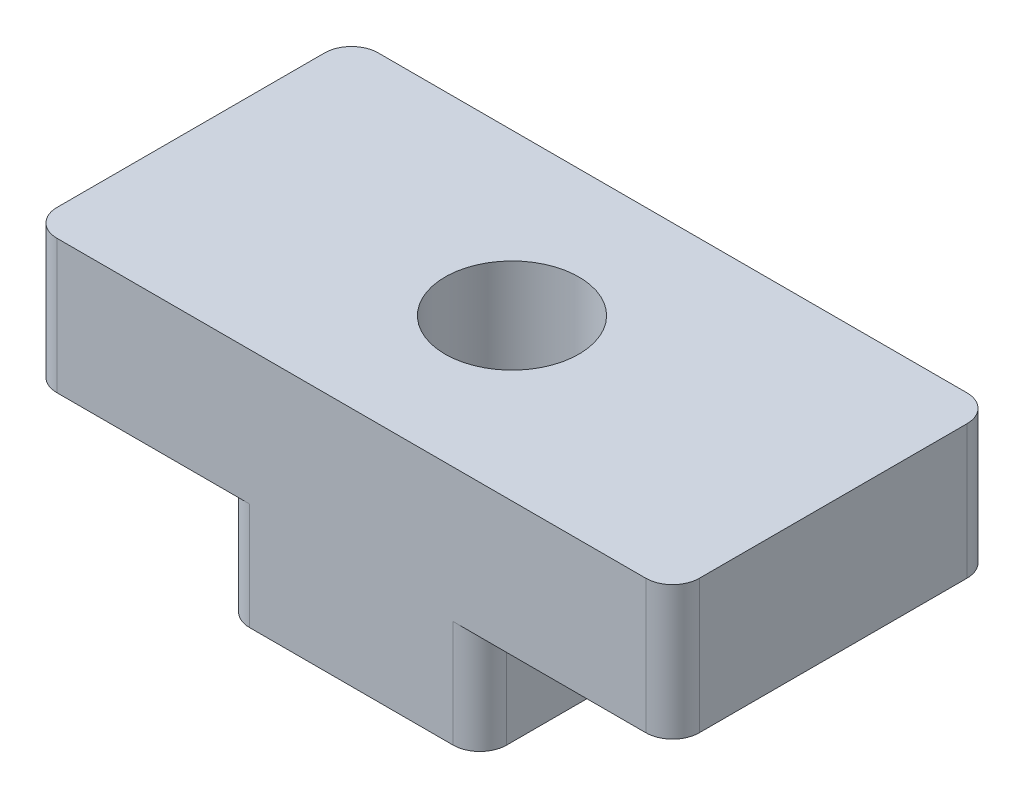
ISO-10303-21;
HEADER;
FILE_DESCRIPTION(('STEP AP214'),'2;1');
FILE_NAME('part.step','',(''),(''),'','','');
FILE_SCHEMA(('AUTOMOTIVE_DESIGN { 1 0 10303 214 1 1 1 1 }'));
ENDSEC;
DATA;
#1=APPLICATION_CONTEXT('core data for automotive mechanical design processes');
#2=APPLICATION_PROTOCOL_DEFINITION('international standard','automotive_design',2000,#1);
#3=PRODUCT_CONTEXT('',#1,'mechanical');
#4=PRODUCT('Part','Part','',(#3));
#5=PRODUCT_RELATED_PRODUCT_CATEGORY('part','',(#4));
#6=PRODUCT_DEFINITION_FORMATION('','',#4);
#7=PRODUCT_DEFINITION_CONTEXT('part definition',#1,'design');
#8=PRODUCT_DEFINITION('design','',#6,#7);
#9=PRODUCT_DEFINITION_SHAPE('','',#8);
#10=(LENGTH_UNIT() NAMED_UNIT(*) SI_UNIT(.MILLI.,.METRE.));
#11=(NAMED_UNIT(*) PLANE_ANGLE_UNIT() SI_UNIT($,.RADIAN.));
#12=(NAMED_UNIT(*) SI_UNIT($,.STERADIAN.) SOLID_ANGLE_UNIT());
#13=UNCERTAINTY_MEASURE_WITH_UNIT(LENGTH_MEASURE(1.E-05),#10,'distance_accuracy_value','');
#14=(GEOMETRIC_REPRESENTATION_CONTEXT(3) GLOBAL_UNCERTAINTY_ASSIGNED_CONTEXT((#13)) GLOBAL_UNIT_ASSIGNED_CONTEXT((#10,
#11,#12)) REPRESENTATION_CONTEXT('',''));
#15=CARTESIAN_POINT('',(0.,0.,0.));
#16=DIRECTION('',(0.,0.,1.));
#17=DIRECTION('',(1.,0.,0.));
#18=AXIS2_PLACEMENT_3D('',#15,#16,#17);
#19=CARTESIAN_POINT('',(6.,0.,3.));
#20=DIRECTION('',(-1.,0.,0.));
#21=DIRECTION('',(0.,0.,1.));
#22=AXIS2_PLACEMENT_3D('',#19,#20,#21);
#23=PLANE('',#22);
#24=DIRECTION('',(0.,0.,-1.));
#25=VECTOR('',#24,1.);
#26=CARTESIAN_POINT('',(6.,2.5,3.));
#27=LINE('',#26,#25);
#28=CARTESIAN_POINT('',(6.,2.5,2.5));
#29=VERTEX_POINT('',#28);
#30=CARTESIAN_POINT('',(6.,2.5,-2.5));
#31=VERTEX_POINT('',#30);
#32=EDGE_CURVE('E192',#29,#31,#27,.T.);
#33=ORIENTED_EDGE('',*,*,#32,.F.);
#34=DIRECTION('',(0.,1.,0.));
#35=VECTOR('',#34,1.);
#36=CARTESIAN_POINT('',(6.,0.,2.5));
#37=LINE('',#36,#35);
#38=CARTESIAN_POINT('',(6.,0.,2.5));
#39=VERTEX_POINT('',#38);
#40=EDGE_CURVE('E266',#29,#39,#37,.F.);
#41=ORIENTED_EDGE('',*,*,#40,.T.);
#42=DIRECTION('',(0.,0.,-1.));
#43=VECTOR('',#42,1.);
#44=CARTESIAN_POINT('',(6.,0.,3.));
#45=LINE('',#44,#43);
#46=CARTESIAN_POINT('',(6.,0.,-2.5));
#47=VERTEX_POINT('',#46);
#48=EDGE_CURVE('E186',#39,#47,#45,.T.);
#49=ORIENTED_EDGE('',*,*,#48,.T.);
#50=DIRECTION('',(0.,1.,0.));
#51=VECTOR('',#50,1.);
#52=CARTESIAN_POINT('',(6.,2.5,-2.5));
#53=LINE('',#52,#51);
#54=EDGE_CURVE('E262',#47,#31,#53,.T.);
#55=ORIENTED_EDGE('',*,*,#54,.T.);
#56=EDGE_LOOP('',(#33,#41,#49,#55));
#57=FACE_BOUND('',#56,.T.);
#58=ADVANCED_FACE('F47',(#57),#23,.F.);
#59=CARTESIAN_POINT('',(-6.,2.5,3.));
#60=DIRECTION('',(0.,-1.,0.));
#61=DIRECTION('',(0.,0.,-1.));
#62=AXIS2_PLACEMENT_3D('',#59,#60,#61);
#63=PLANE('',#62);
#64=CARTESIAN_POINT('',(0.,2.5,0.));
#65=DIRECTION('',(0.,1.,0.));
#66=DIRECTION('',(0.,0.,1.));
#67=AXIS2_PLACEMENT_3D('',#64,#65,#66);
#68=CIRCLE('',#67,1.25);
#69=CARTESIAN_POINT('',(0.,2.5,1.25));
#70=VERTEX_POINT('',#69);
#71=EDGE_CURVE('E360',#70,#70,#68,.T.);
#72=ORIENTED_EDGE('',*,*,#71,.F.);
#73=EDGE_LOOP('',(#72));
#74=FACE_BOUND('',#73,.T.);
#75=DIRECTION('',(-1.,0.,0.));
#76=VECTOR('',#75,1.);
#77=CARTESIAN_POINT('',(-6.,2.5,3.));
#78=LINE('',#77,#76);
#79=CARTESIAN_POINT('',(5.5,2.5,3.));
#80=VERTEX_POINT('',#79);
#81=CARTESIAN_POINT('',(-5.5,2.5,3.));
#82=VERTEX_POINT('',#81);
#83=EDGE_CURVE('E327',#80,#82,#78,.T.);
#84=ORIENTED_EDGE('',*,*,#83,.F.);
#85=CARTESIAN_POINT('',(5.5,2.5,2.5));
#86=DIRECTION('',(0.,-1.,0.));
#87=DIRECTION('',(0.,0.,-1.));
#88=AXIS2_PLACEMENT_3D('',#85,#86,#87);
#89=CIRCLE('',#88,0.5);
#90=EDGE_CURVE('E259',#80,#29,#89,.F.);
#91=ORIENTED_EDGE('',*,*,#90,.T.);
#92=ORIENTED_EDGE('',*,*,#32,.T.);
#93=CARTESIAN_POINT('',(5.5,2.5,-2.5));
#94=DIRECTION('',(0.,-1.,0.));
#95=DIRECTION('',(0.,0.,-1.));
#96=AXIS2_PLACEMENT_3D('',#93,#94,#95);
#97=CIRCLE('',#96,0.5);
#98=CARTESIAN_POINT('',(5.5,2.5,-3.));
#99=VERTEX_POINT('',#98);
#100=EDGE_CURVE('E253',#31,#99,#97,.F.);
#101=ORIENTED_EDGE('',*,*,#100,.T.);
#102=DIRECTION('',(-1.,0.,0.));
#103=VECTOR('',#102,1.);
#104=CARTESIAN_POINT('',(-6.,2.5,-3.));
#105=LINE('',#104,#103);
#106=CARTESIAN_POINT('',(-5.5,2.5,-3.));
#107=VERTEX_POINT('',#106);
#108=EDGE_CURVE('E330',#99,#107,#105,.T.);
#109=ORIENTED_EDGE('',*,*,#108,.T.);
#110=CARTESIAN_POINT('',(-5.5,2.5,-2.5));
#111=DIRECTION('',(0.,-1.,0.));
#112=DIRECTION('',(0.,0.,-1.));
#113=AXIS2_PLACEMENT_3D('',#110,#111,#112);
#114=CIRCLE('',#113,0.5);
#115=CARTESIAN_POINT('',(-6.,2.5,-2.5));
#116=VERTEX_POINT('',#115);
#117=EDGE_CURVE('E250',#107,#116,#114,.F.);
#118=ORIENTED_EDGE('',*,*,#117,.T.);
#119=DIRECTION('',(0.,0.,-1.));
#120=VECTOR('',#119,1.);
#121=CARTESIAN_POINT('',(-6.,2.5,3.));
#122=LINE('',#121,#120);
#123=CARTESIAN_POINT('',(-6.,2.5,2.5));
#124=VERTEX_POINT('',#123);
#125=EDGE_CURVE('E202',#124,#116,#122,.T.);
#126=ORIENTED_EDGE('',*,*,#125,.F.);
#127=CARTESIAN_POINT('',(-5.5,2.5,2.5));
#128=DIRECTION('',(0.,-1.,0.));
#129=DIRECTION('',(0.,0.,-1.));
#130=AXIS2_PLACEMENT_3D('',#127,#128,#129);
#131=CIRCLE('',#130,0.5);
#132=EDGE_CURVE('E256',#124,#82,#131,.F.);
#133=ORIENTED_EDGE('',*,*,#132,.T.);
#134=EDGE_LOOP('',(#84,#91,#92,#101,#109,#118,#126,#133));
#135=FACE_BOUND('',#134,.T.);
#136=ADVANCED_FACE('F352',(#74,#135),#63,.F.);
#137=CARTESIAN_POINT('',(-6.,0.,3.));
#138=DIRECTION('',(1.,0.,0.));
#139=DIRECTION('',(0.,0.,-1.));
#140=AXIS2_PLACEMENT_3D('',#137,#138,#139);
#141=PLANE('',#140);
#142=DIRECTION('',(0.,0.,-1.));
#143=VECTOR('',#142,1.);
#144=CARTESIAN_POINT('',(-6.,0.,3.));
#145=LINE('',#144,#143);
#146=CARTESIAN_POINT('',(-6.,0.,2.5));
#147=VERTEX_POINT('',#146);
#148=CARTESIAN_POINT('',(-6.,0.,-2.5));
#149=VERTEX_POINT('',#148);
#150=EDGE_CURVE('E307',#147,#149,#145,.T.);
#151=ORIENTED_EDGE('',*,*,#150,.F.);
#152=DIRECTION('',(0.,-1.,0.));
#153=VECTOR('',#152,1.);
#154=CARTESIAN_POINT('',(-6.,0.,2.5));
#155=LINE('',#154,#153);
#156=EDGE_CURVE('E282',#147,#124,#155,.F.);
#157=ORIENTED_EDGE('',*,*,#156,.T.);
#158=ORIENTED_EDGE('',*,*,#125,.T.);
#159=DIRECTION('',(0.,-1.,0.));
#160=VECTOR('',#159,1.);
#161=CARTESIAN_POINT('',(-6.,0.,-2.5));
#162=LINE('',#161,#160);
#163=EDGE_CURVE('E279',#116,#149,#162,.T.);
#164=ORIENTED_EDGE('',*,*,#163,.T.);
#165=EDGE_LOOP('',(#151,#157,#158,#164));
#166=FACE_BOUND('',#165,.T.);
#167=ADVANCED_FACE('F345',(#166),#141,.F.);
#168=CARTESIAN_POINT('',(-6.,0.,3.));
#169=DIRECTION('',(0.,1.,0.));
#170=DIRECTION('',(-1.,0.,0.));
#171=AXIS2_PLACEMENT_3D('',#168,#169,#170);
#172=PLANE('',#171);
#173=DIRECTION('',(1.,0.,0.));
#174=VECTOR('',#173,1.);
#175=CARTESIAN_POINT('',(-6.,0.,3.));
#176=LINE('',#175,#174);
#177=CARTESIAN_POINT('',(-5.5,0.,3.));
#178=VERTEX_POINT('',#177);
#179=CARTESIAN_POINT('',(-1.9,0.,3.));
#180=VERTEX_POINT('',#179);
#181=EDGE_CURVE('E369',#178,#180,#176,.T.);
#182=ORIENTED_EDGE('',*,*,#181,.F.);
#183=CARTESIAN_POINT('',(-5.5,0.,2.5));
#184=DIRECTION('',(0.,1.,0.));
#185=DIRECTION('',(-1.,0.,0.));
#186=AXIS2_PLACEMENT_3D('',#183,#184,#185);
#187=CIRCLE('',#186,0.5);
#188=EDGE_CURVE('E71',#178,#147,#187,.F.);
#189=ORIENTED_EDGE('',*,*,#188,.T.);
#190=ORIENTED_EDGE('',*,*,#150,.T.);
#191=CARTESIAN_POINT('',(-5.5,0.,-2.5));
#192=DIRECTION('',(0.,1.,0.));
#193=DIRECTION('',(-1.,0.,0.));
#194=AXIS2_PLACEMENT_3D('',#191,#192,#193);
#195=CIRCLE('',#194,0.5);
#196=CARTESIAN_POINT('',(-5.5,0.,-3.));
#197=VERTEX_POINT('',#196);
#198=EDGE_CURVE('E63',#149,#197,#195,.F.);
#199=ORIENTED_EDGE('',*,*,#198,.T.);
#200=DIRECTION('',(1.,0.,0.));
#201=VECTOR('',#200,1.);
#202=CARTESIAN_POINT('',(-6.,0.,-3.));
#203=LINE('',#202,#201);
#204=CARTESIAN_POINT('',(-1.9,0.,-3.));
#205=VERTEX_POINT('',#204);
#206=EDGE_CURVE('E297',#197,#205,#203,.T.);
#207=ORIENTED_EDGE('',*,*,#206,.T.);
#208=CARTESIAN_POINT('',(-1.9,0.,-2.5));
#209=DIRECTION('',(0.,1.,0.));
#210=DIRECTION('',(-1.,0.,0.));
#211=AXIS2_PLACEMENT_3D('',#208,#209,#210);
#212=CIRCLE('',#211,0.5);
#213=CARTESIAN_POINT('',(-2.4,0.,-2.5));
#214=VERTEX_POINT('',#213);
#215=EDGE_CURVE('E175',#205,#214,#212,.T.);
#216=ORIENTED_EDGE('',*,*,#215,.T.);
#217=DIRECTION('',(0.,0.,-1.));
#218=VECTOR('',#217,1.);
#219=CARTESIAN_POINT('',(-2.4,0.,3.));
#220=LINE('',#219,#218);
#221=CARTESIAN_POINT('',(-2.4,0.,2.5));
#222=VERTEX_POINT('',#221);
#223=EDGE_CURVE('E294',#222,#214,#220,.T.);
#224=ORIENTED_EDGE('',*,*,#223,.F.);
#225=CARTESIAN_POINT('',(-1.9,0.,2.5));
#226=DIRECTION('',(0.,1.,0.));
#227=DIRECTION('',(-1.,0.,0.));
#228=AXIS2_PLACEMENT_3D('',#225,#226,#227);
#229=CIRCLE('',#228,0.5);
#230=EDGE_CURVE('E11',#222,#180,#229,.T.);
#231=ORIENTED_EDGE('',*,*,#230,.T.);
#232=EDGE_LOOP('',(#182,#189,#190,#199,#207,#216,#224,#231));
#233=FACE_BOUND('',#232,.T.);
#234=ADVANCED_FACE('F293',(#233),#172,.F.);
#235=CARTESIAN_POINT('',(-2.4,0.,3.));
#236=DIRECTION('',(1.,0.,0.));
#237=DIRECTION('',(0.,1.,0.));
#238=AXIS2_PLACEMENT_3D('',#235,#236,#237);
#239=PLANE('',#238);
#240=ORIENTED_EDGE('',*,*,#223,.T.);
#241=DIRECTION('',(0.,-1.,0.));
#242=VECTOR('',#241,1.);
#243=CARTESIAN_POINT('',(-2.4,-2.,-2.5));
#244=LINE('',#243,#242);
#245=CARTESIAN_POINT('',(-2.4,-2.,-2.5));
#246=VERTEX_POINT('',#245);
#247=EDGE_CURVE('E231',#214,#246,#244,.T.);
#248=ORIENTED_EDGE('',*,*,#247,.T.);
#249=DIRECTION('',(0.,0.,-1.));
#250=VECTOR('',#249,1.);
#251=CARTESIAN_POINT('',(-2.4,-2.,3.));
#252=LINE('',#251,#250);
#253=CARTESIAN_POINT('',(-2.4,-2.,2.5));
#254=VERTEX_POINT('',#253);
#255=EDGE_CURVE('E308',#254,#246,#252,.T.);
#256=ORIENTED_EDGE('',*,*,#255,.F.);
#257=DIRECTION('',(0.,-1.,0.));
#258=VECTOR('',#257,1.);
#259=CARTESIAN_POINT('',(-2.4,0.,2.5));
#260=LINE('',#259,#258);
#261=EDGE_CURVE('E228',#254,#222,#260,.F.);
#262=ORIENTED_EDGE('',*,*,#261,.T.);
#263=EDGE_LOOP('',(#240,#248,#256,#262));
#264=FACE_BOUND('',#263,.T.);
#265=ADVANCED_FACE('F302',(#264),#239,.F.);
#266=CARTESIAN_POINT('',(-2.4,-2.,3.));
#267=DIRECTION('',(0.,1.,0.));
#268=DIRECTION('',(-1.,0.,0.));
#269=AXIS2_PLACEMENT_3D('',#266,#267,#268);
#270=PLANE('',#269);
#271=CARTESIAN_POINT('',(0.,-2.,0.));
#272=DIRECTION('',(0.,1.,0.));
#273=DIRECTION('',(0.,0.,1.));
#274=AXIS2_PLACEMENT_3D('',#271,#272,#273);
#275=CIRCLE('',#274,1.25);
#276=CARTESIAN_POINT('',(0.,-2.,1.25));
#277=VERTEX_POINT('',#276);
#278=EDGE_CURVE('E356',#277,#277,#275,.T.);
#279=ORIENTED_EDGE('',*,*,#278,.T.);
#280=EDGE_LOOP('',(#279));
#281=FACE_BOUND('',#280,.T.);
#282=DIRECTION('',(1.,0.,0.));
#283=VECTOR('',#282,1.);
#284=CARTESIAN_POINT('',(-2.4,-2.,-3.));
#285=LINE('',#284,#283);
#286=CARTESIAN_POINT('',(-1.9,-2.,-3.));
#287=VERTEX_POINT('',#286);
#288=CARTESIAN_POINT('',(1.9,-2.,-3.));
#289=VERTEX_POINT('',#288);
#290=EDGE_CURVE('E315',#287,#289,#285,.T.);
#291=ORIENTED_EDGE('',*,*,#290,.T.);
#292=CARTESIAN_POINT('',(1.9,-2.,-2.5));
#293=DIRECTION('',(0.,1.,0.));
#294=DIRECTION('',(-1.,0.,0.));
#295=AXIS2_PLACEMENT_3D('',#292,#293,#294);
#296=CIRCLE('',#295,0.5);
#297=CARTESIAN_POINT('',(2.4,-2.,-2.5));
#298=VERTEX_POINT('',#297);
#299=EDGE_CURVE('E225',#289,#298,#296,.F.);
#300=ORIENTED_EDGE('',*,*,#299,.T.);
#301=DIRECTION('',(0.,0.,-1.));
#302=VECTOR('',#301,1.);
#303=CARTESIAN_POINT('',(2.4,-2.,3.));
#304=LINE('',#303,#302);
#305=CARTESIAN_POINT('',(2.4,-2.,2.5));
#306=VERTEX_POINT('',#305);
#307=EDGE_CURVE('E185',#306,#298,#304,.T.);
#308=ORIENTED_EDGE('',*,*,#307,.F.);
#309=CARTESIAN_POINT('',(1.9,-2.,2.5));
#310=DIRECTION('',(0.,1.,0.));
#311=DIRECTION('',(-1.,0.,0.));
#312=AXIS2_PLACEMENT_3D('',#309,#310,#311);
#313=CIRCLE('',#312,0.5);
#314=CARTESIAN_POINT('',(1.9,-2.,3.));
#315=VERTEX_POINT('',#314);
#316=EDGE_CURVE('E190',#306,#315,#313,.F.);
#317=ORIENTED_EDGE('',*,*,#316,.T.);
#318=DIRECTION('',(1.,0.,0.));
#319=VECTOR('',#318,1.);
#320=CARTESIAN_POINT('',(-2.4,-2.,3.));
#321=LINE('',#320,#319);
#322=CARTESIAN_POINT('',(-1.9,-2.,3.));
#323=VERTEX_POINT('',#322);
#324=EDGE_CURVE('E365',#323,#315,#321,.T.);
#325=ORIENTED_EDGE('',*,*,#324,.F.);
#326=CARTESIAN_POINT('',(-1.9,-2.,2.5));
#327=DIRECTION('',(0.,1.,0.));
#328=DIRECTION('',(-1.,0.,0.));
#329=AXIS2_PLACEMENT_3D('',#326,#327,#328);
#330=CIRCLE('',#329,0.5);
#331=EDGE_CURVE('E218',#323,#254,#330,.F.);
#332=ORIENTED_EDGE('',*,*,#331,.T.);
#333=ORIENTED_EDGE('',*,*,#255,.T.);
#334=CARTESIAN_POINT('',(-1.9,-2.,-2.5));
#335=DIRECTION('',(0.,1.,0.));
#336=DIRECTION('',(-1.,0.,0.));
#337=AXIS2_PLACEMENT_3D('',#334,#335,#336);
#338=CIRCLE('',#337,0.5);
#339=EDGE_CURVE('E222',#246,#287,#338,.F.);
#340=ORIENTED_EDGE('',*,*,#339,.T.);
#341=EDGE_LOOP('',(#291,#300,#308,#317,#325,#332,#333,#340));
#342=FACE_BOUND('',#341,.T.);
#343=ADVANCED_FACE('F314',(#281,#342),#270,.F.);
#344=CARTESIAN_POINT('',(2.4,0.,3.));
#345=DIRECTION('',(-1.,0.,0.));
#346=DIRECTION('',(0.,-1.,0.));
#347=AXIS2_PLACEMENT_3D('',#344,#345,#346);
#348=PLANE('',#347);
#349=ORIENTED_EDGE('',*,*,#307,.T.);
#350=DIRECTION('',(0.,1.,0.));
#351=VECTOR('',#350,1.);
#352=CARTESIAN_POINT('',(2.4,0.,-2.5));
#353=LINE('',#352,#351);
#354=CARTESIAN_POINT('',(2.4,0.,-2.5));
#355=VERTEX_POINT('',#354);
#356=EDGE_CURVE('E183',#298,#355,#353,.T.);
#357=ORIENTED_EDGE('',*,*,#356,.T.);
#358=DIRECTION('',(0.,0.,-1.));
#359=VECTOR('',#358,1.);
#360=CARTESIAN_POINT('',(2.4,0.,3.));
#361=LINE('',#360,#359);
#362=CARTESIAN_POINT('',(2.4,0.,2.5));
#363=VERTEX_POINT('',#362);
#364=EDGE_CURVE('E167',#363,#355,#361,.T.);
#365=ORIENTED_EDGE('',*,*,#364,.F.);
#366=DIRECTION('',(0.,1.,0.));
#367=VECTOR('',#366,1.);
#368=CARTESIAN_POINT('',(2.4,0.,2.5));
#369=LINE('',#368,#367);
#370=EDGE_CURVE('E180',#363,#306,#369,.F.);
#371=ORIENTED_EDGE('',*,*,#370,.T.);
#372=EDGE_LOOP('',(#349,#357,#365,#371));
#373=FACE_BOUND('',#372,.T.);
#374=ADVANCED_FACE('F179',(#373),#348,.F.);
#375=CARTESIAN_POINT('',(6.,0.,3.));
#376=DIRECTION('',(0.,1.,0.));
#377=DIRECTION('',(-1.,0.,0.));
#378=AXIS2_PLACEMENT_3D('',#375,#376,#377);
#379=PLANE('',#378);
#380=ORIENTED_EDGE('',*,*,#48,.F.);
#381=CARTESIAN_POINT('',(5.5,0.,2.5));
#382=DIRECTION('',(0.,1.,0.));
#383=DIRECTION('',(-1.,0.,0.));
#384=AXIS2_PLACEMENT_3D('',#381,#382,#383);
#385=CIRCLE('',#384,0.5);
#386=CARTESIAN_POINT('',(5.5,0.,3.));
#387=VERTEX_POINT('',#386);
#388=EDGE_CURVE('E272',#39,#387,#385,.F.);
#389=ORIENTED_EDGE('',*,*,#388,.T.);
#390=DIRECTION('',(1.,0.,0.));
#391=VECTOR('',#390,1.);
#392=CARTESIAN_POINT('',(6.,0.,3.));
#393=LINE('',#392,#391);
#394=CARTESIAN_POINT('',(1.9,0.,3.));
#395=VERTEX_POINT('',#394);
#396=EDGE_CURVE('E169',#395,#387,#393,.T.);
#397=ORIENTED_EDGE('',*,*,#396,.F.);
#398=CARTESIAN_POINT('',(1.9,0.,2.5));
#399=DIRECTION('',(0.,1.,0.));
#400=DIRECTION('',(-1.,0.,0.));
#401=AXIS2_PLACEMENT_3D('',#398,#399,#400);
#402=CIRCLE('',#401,0.5);
#403=EDGE_CURVE('E56',#395,#363,#402,.T.);
#404=ORIENTED_EDGE('',*,*,#403,.T.);
#405=ORIENTED_EDGE('',*,*,#364,.T.);
#406=CARTESIAN_POINT('',(1.9,0.,-2.5));
#407=DIRECTION('',(0.,1.,0.));
#408=DIRECTION('',(-1.,0.,0.));
#409=AXIS2_PLACEMENT_3D('',#406,#407,#408);
#410=CIRCLE('',#409,0.5);
#411=CARTESIAN_POINT('',(1.9,0.,-3.));
#412=VERTEX_POINT('',#411);
#413=EDGE_CURVE('E285',#355,#412,#410,.T.);
#414=ORIENTED_EDGE('',*,*,#413,.T.);
#415=DIRECTION('',(1.,0.,0.));
#416=VECTOR('',#415,1.);
#417=CARTESIAN_POINT('',(6.,0.,-3.));
#418=LINE('',#417,#416);
#419=CARTESIAN_POINT('',(5.5,0.,-3.));
#420=VERTEX_POINT('',#419);
#421=EDGE_CURVE('E321',#412,#420,#418,.T.);
#422=ORIENTED_EDGE('',*,*,#421,.T.);
#423=CARTESIAN_POINT('',(5.5,0.,-2.5));
#424=DIRECTION('',(0.,1.,0.));
#425=DIRECTION('',(-1.,0.,0.));
#426=AXIS2_PLACEMENT_3D('',#423,#424,#425);
#427=CIRCLE('',#426,0.5);
#428=EDGE_CURVE('E269',#420,#47,#427,.F.);
#429=ORIENTED_EDGE('',*,*,#428,.T.);
#430=EDGE_LOOP('',(#380,#389,#397,#404,#405,#414,#422,#429));
#431=FACE_BOUND('',#430,.T.);
#432=ADVANCED_FACE('F165',(#431),#379,.F.);
#433=CARTESIAN_POINT('',(0.,0.,3.));
#434=DIRECTION('',(0.,0.,-1.));
#435=DIRECTION('',(-1.,0.,0.));
#436=AXIS2_PLACEMENT_3D('',#433,#434,#435);
#437=PLANE('',#436);
#438=ORIENTED_EDGE('',*,*,#324,.T.);
#439=DIRECTION('',(0.,1.,0.));
#440=VECTOR('',#439,1.);
#441=CARTESIAN_POINT('',(1.9,0.,3.));
#442=LINE('',#441,#440);
#443=EDGE_CURVE('E247',#315,#395,#442,.T.);
#444=ORIENTED_EDGE('',*,*,#443,.T.);
#445=ORIENTED_EDGE('',*,*,#396,.T.);
#446=DIRECTION('',(0.,1.,0.));
#447=VECTOR('',#446,1.);
#448=CARTESIAN_POINT('',(5.5,0.,3.));
#449=LINE('',#448,#447);
#450=EDGE_CURVE('E239',#387,#80,#449,.T.);
#451=ORIENTED_EDGE('',*,*,#450,.T.);
#452=ORIENTED_EDGE('',*,*,#83,.T.);
#453=DIRECTION('',(0.,-1.,0.));
#454=VECTOR('',#453,1.);
#455=CARTESIAN_POINT('',(-5.5,0.,3.));
#456=LINE('',#455,#454);
#457=EDGE_CURVE('E235',#82,#178,#456,.T.);
#458=ORIENTED_EDGE('',*,*,#457,.T.);
#459=ORIENTED_EDGE('',*,*,#181,.T.);
#460=DIRECTION('',(0.,-1.,0.));
#461=VECTOR('',#460,1.);
#462=CARTESIAN_POINT('',(-1.9,0.,3.));
#463=LINE('',#462,#461);
#464=EDGE_CURVE('E243',#180,#323,#463,.T.);
#465=ORIENTED_EDGE('',*,*,#464,.T.);
#466=EDGE_LOOP('',(#438,#444,#445,#451,#452,#458,#459,#465));
#467=FACE_BOUND('',#466,.T.);
#468=ADVANCED_FACE('F425',(#467),#437,.F.);
#469=CARTESIAN_POINT('',(0.,0.,-3.));
#470=DIRECTION('',(0.,0.,-1.));
#471=DIRECTION('',(-1.,0.,0.));
#472=AXIS2_PLACEMENT_3D('',#469,#470,#471);
#473=PLANE('',#472);
#474=ORIENTED_EDGE('',*,*,#421,.F.);
#475=DIRECTION('',(0.,1.,0.));
#476=VECTOR('',#475,1.);
#477=CARTESIAN_POINT('',(1.9,-2.,-3.));
#478=LINE('',#477,#476);
#479=EDGE_CURVE('E215',#412,#289,#478,.F.);
#480=ORIENTED_EDGE('',*,*,#479,.T.);
#481=ORIENTED_EDGE('',*,*,#290,.F.);
#482=DIRECTION('',(0.,-1.,0.));
#483=VECTOR('',#482,1.);
#484=CARTESIAN_POINT('',(-1.9,0.,-3.));
#485=LINE('',#484,#483);
#486=EDGE_CURVE('E211',#287,#205,#485,.F.);
#487=ORIENTED_EDGE('',*,*,#486,.T.);
#488=ORIENTED_EDGE('',*,*,#206,.F.);
#489=DIRECTION('',(0.,-1.,0.));
#490=VECTOR('',#489,1.);
#491=CARTESIAN_POINT('',(-5.5,2.5,-3.));
#492=LINE('',#491,#490);
#493=EDGE_CURVE('E198',#197,#107,#492,.F.);
#494=ORIENTED_EDGE('',*,*,#493,.T.);
#495=ORIENTED_EDGE('',*,*,#108,.F.);
#496=DIRECTION('',(0.,1.,0.));
#497=VECTOR('',#496,1.);
#498=CARTESIAN_POINT('',(5.5,0.,-3.));
#499=LINE('',#498,#497);
#500=EDGE_CURVE('E208',#99,#420,#499,.F.);
#501=ORIENTED_EDGE('',*,*,#500,.T.);
#502=EDGE_LOOP('',(#474,#480,#481,#487,#488,#494,#495,#501));
#503=FACE_BOUND('',#502,.T.);
#504=ADVANCED_FACE('F318',(#503),#473,.T.);
#505=CARTESIAN_POINT('',(0.,-2.,0.));
#506=DIRECTION('',(0.,1.,0.));
#507=DIRECTION('',(0.,0.,1.));
#508=AXIS2_PLACEMENT_3D('',#505,#506,#507);
#509=CYLINDRICAL_SURFACE('',#508,1.25);
#510=ORIENTED_EDGE('',*,*,#278,.F.);
#511=EDGE_LOOP('',(#510));
#512=FACE_BOUND('',#511,.T.);
#513=ORIENTED_EDGE('',*,*,#71,.T.);
#514=EDGE_LOOP('',(#513));
#515=FACE_BOUND('',#514,.T.);
#516=ADVANCED_FACE('F380',(#512,#515),#509,.F.);
#517=CARTESIAN_POINT('',(1.9,0.,-2.5));
#518=DIRECTION('',(0.,-1.,0.));
#519=DIRECTION('',(1.,0.,0.));
#520=AXIS2_PLACEMENT_3D('',#517,#518,#519);
#521=CYLINDRICAL_SURFACE('',#520,0.5);
#522=ORIENTED_EDGE('',*,*,#299,.F.);
#523=ORIENTED_EDGE('',*,*,#479,.F.);
#524=ORIENTED_EDGE('',*,*,#413,.F.);
#525=ORIENTED_EDGE('',*,*,#356,.F.);
#526=EDGE_LOOP('',(#522,#523,#524,#525));
#527=FACE_BOUND('',#526,.T.);
#528=ADVANCED_FACE('F393',(#527),#521,.T.);
#529=CARTESIAN_POINT('',(-1.9,0.,-2.5));
#530=DIRECTION('',(0.,1.,0.));
#531=DIRECTION('',(-1.,0.,0.));
#532=AXIS2_PLACEMENT_3D('',#529,#530,#531);
#533=CYLINDRICAL_SURFACE('',#532,0.5);
#534=ORIENTED_EDGE('',*,*,#215,.F.);
#535=ORIENTED_EDGE('',*,*,#486,.F.);
#536=ORIENTED_EDGE('',*,*,#339,.F.);
#537=ORIENTED_EDGE('',*,*,#247,.F.);
#538=EDGE_LOOP('',(#534,#535,#536,#537));
#539=FACE_BOUND('',#538,.T.);
#540=ADVANCED_FACE('F310',(#539),#533,.T.);
#541=CARTESIAN_POINT('',(1.9,0.,2.5));
#542=DIRECTION('',(0.,1.,0.));
#543=DIRECTION('',(-1.,0.,0.));
#544=AXIS2_PLACEMENT_3D('',#541,#542,#543);
#545=CYLINDRICAL_SURFACE('',#544,0.5);
#546=ORIENTED_EDGE('',*,*,#316,.F.);
#547=ORIENTED_EDGE('',*,*,#370,.F.);
#548=ORIENTED_EDGE('',*,*,#403,.F.);
#549=ORIENTED_EDGE('',*,*,#443,.F.);
#550=EDGE_LOOP('',(#546,#547,#548,#549));
#551=FACE_BOUND('',#550,.T.);
#552=ADVANCED_FACE('F189',(#551),#545,.T.);
#553=CARTESIAN_POINT('',(-1.9,0.,2.5));
#554=DIRECTION('',(0.,-1.,0.));
#555=DIRECTION('',(1.,0.,0.));
#556=AXIS2_PLACEMENT_3D('',#553,#554,#555);
#557=CYLINDRICAL_SURFACE('',#556,0.5);
#558=ORIENTED_EDGE('',*,*,#230,.F.);
#559=ORIENTED_EDGE('',*,*,#261,.F.);
#560=ORIENTED_EDGE('',*,*,#331,.F.);
#561=ORIENTED_EDGE('',*,*,#464,.F.);
#562=EDGE_LOOP('',(#558,#559,#560,#561));
#563=FACE_BOUND('',#562,.T.);
#564=ADVANCED_FACE('F401',(#563),#557,.T.);
#565=CARTESIAN_POINT('',(5.5,0.,2.5));
#566=DIRECTION('',(0.,1.,0.));
#567=DIRECTION('',(0.,0.,1.));
#568=AXIS2_PLACEMENT_3D('',#565,#566,#567);
#569=CYLINDRICAL_SURFACE('',#568,0.5);
#570=ORIENTED_EDGE('',*,*,#388,.F.);
#571=ORIENTED_EDGE('',*,*,#40,.F.);
#572=ORIENTED_EDGE('',*,*,#90,.F.);
#573=ORIENTED_EDGE('',*,*,#450,.F.);
#574=EDGE_LOOP('',(#570,#571,#572,#573));
#575=FACE_BOUND('',#574,.T.);
#576=ADVANCED_FACE('F404',(#575),#569,.T.);
#577=CARTESIAN_POINT('',(-5.5,0.,2.5));
#578=DIRECTION('',(0.,-1.,0.));
#579=DIRECTION('',(0.,0.,-1.));
#580=AXIS2_PLACEMENT_3D('',#577,#578,#579);
#581=CYLINDRICAL_SURFACE('',#580,0.5);
#582=ORIENTED_EDGE('',*,*,#132,.F.);
#583=ORIENTED_EDGE('',*,*,#156,.F.);
#584=ORIENTED_EDGE('',*,*,#188,.F.);
#585=ORIENTED_EDGE('',*,*,#457,.F.);
#586=EDGE_LOOP('',(#582,#583,#584,#585));
#587=FACE_BOUND('',#586,.T.);
#588=ADVANCED_FACE('F408',(#587),#581,.T.);
#589=CARTESIAN_POINT('',(5.5,0.,-2.5));
#590=DIRECTION('',(0.,-1.,0.));
#591=DIRECTION('',(0.,0.,-1.));
#592=AXIS2_PLACEMENT_3D('',#589,#590,#591);
#593=CYLINDRICAL_SURFACE('',#592,0.5);
#594=ORIENTED_EDGE('',*,*,#428,.F.);
#595=ORIENTED_EDGE('',*,*,#500,.F.);
#596=ORIENTED_EDGE('',*,*,#100,.F.);
#597=ORIENTED_EDGE('',*,*,#54,.F.);
#598=EDGE_LOOP('',(#594,#595,#596,#597));
#599=FACE_BOUND('',#598,.T.);
#600=ADVANCED_FACE('F411',(#599),#593,.T.);
#601=CARTESIAN_POINT('',(-5.5,0.,-2.5));
#602=DIRECTION('',(0.,1.,0.));
#603=DIRECTION('',(0.,0.,1.));
#604=AXIS2_PLACEMENT_3D('',#601,#602,#603);
#605=CYLINDRICAL_SURFACE('',#604,0.5);
#606=ORIENTED_EDGE('',*,*,#117,.F.);
#607=ORIENTED_EDGE('',*,*,#493,.F.);
#608=ORIENTED_EDGE('',*,*,#198,.F.);
#609=ORIENTED_EDGE('',*,*,#163,.F.);
#610=EDGE_LOOP('',(#606,#607,#608,#609));
#611=FACE_BOUND('',#610,.T.);
#612=ADVANCED_FACE('F49',(#611),#605,.T.);
#613=CLOSED_SHELL('',(#58,#136,#167,#234,#265,#343,#374,#432,#468,#504,#516,#528,#540,#552,#564,
#576,#588,#600,#612));
#614=MANIFOLD_SOLID_BREP('B2',#613);
#615=ADVANCED_BREP_SHAPE_REPRESENTATION('',(#18,#614),#14);
#616=SHAPE_DEFINITION_REPRESENTATION(#9,#615);
ENDSEC;
END-ISO-10303-21;
